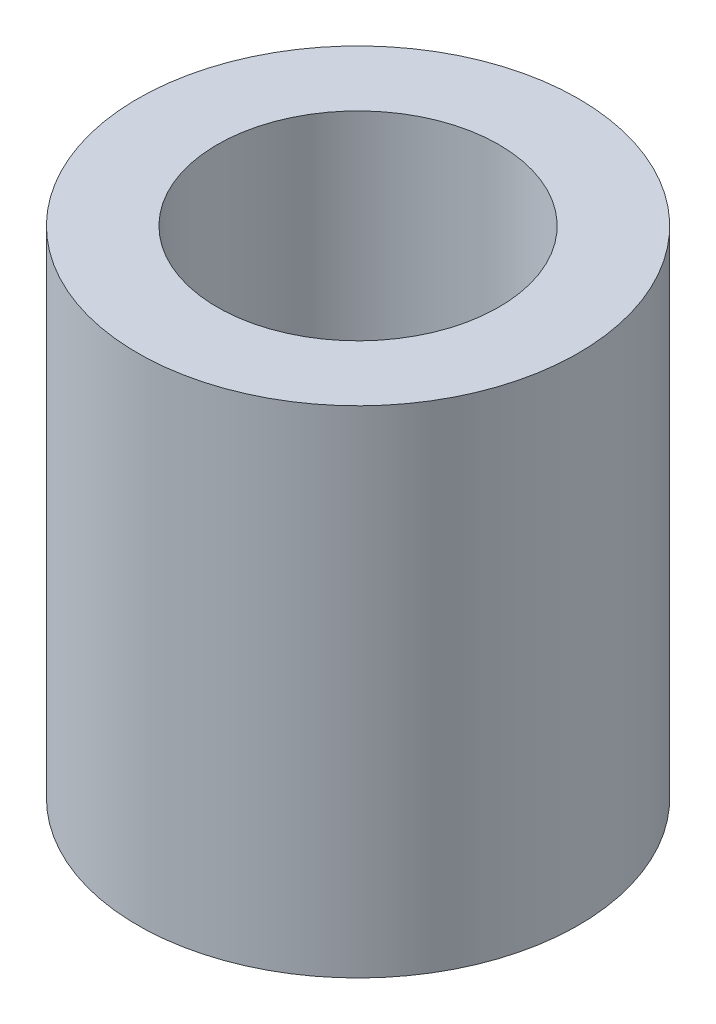
ISO-10303-21;
HEADER;
FILE_DESCRIPTION(('STEP AP214'),'2;1');
FILE_NAME('part.step','',(''),(''),'','','');
FILE_SCHEMA(('AUTOMOTIVE_DESIGN { 1 0 10303 214 1 1 1 1 }'));
ENDSEC;
DATA;
#1=APPLICATION_CONTEXT('core data for automotive mechanical design processes');
#2=APPLICATION_PROTOCOL_DEFINITION('international standard','automotive_design',2000,#1);
#3=PRODUCT_CONTEXT('',#1,'mechanical');
#4=PRODUCT('Part','Part','',(#3));
#5=PRODUCT_RELATED_PRODUCT_CATEGORY('part','',(#4));
#6=PRODUCT_DEFINITION_FORMATION('','',#4);
#7=PRODUCT_DEFINITION_CONTEXT('part definition',#1,'design');
#8=PRODUCT_DEFINITION('design','',#6,#7);
#9=PRODUCT_DEFINITION_SHAPE('','',#8);
#10=(LENGTH_UNIT() NAMED_UNIT(*) SI_UNIT(.MILLI.,.METRE.));
#11=(NAMED_UNIT(*) PLANE_ANGLE_UNIT() SI_UNIT($,.RADIAN.));
#12=(NAMED_UNIT(*) SI_UNIT($,.STERADIAN.) SOLID_ANGLE_UNIT());
#13=UNCERTAINTY_MEASURE_WITH_UNIT(LENGTH_MEASURE(1.E-05),#10,'distance_accuracy_value','');
#14=(GEOMETRIC_REPRESENTATION_CONTEXT(3) GLOBAL_UNCERTAINTY_ASSIGNED_CONTEXT((#13)) GLOBAL_UNIT_ASSIGNED_CONTEXT((#10,
#11,#12)) REPRESENTATION_CONTEXT('',''));
#15=CARTESIAN_POINT('',(0.,0.,0.));
#16=DIRECTION('',(0.,0.,1.));
#17=DIRECTION('',(1.,0.,0.));
#18=AXIS2_PLACEMENT_3D('',#15,#16,#17);
#19=CARTESIAN_POINT('',(0.,39.3483778431595,0.));
#20=DIRECTION('',(0.,-1.,0.));
#21=DIRECTION('',(0.,0.,-1.));
#22=AXIS2_PLACEMENT_3D('',#19,#20,#21);
#23=CYLINDRICAL_SURFACE('',#22,17.5);
#24=CARTESIAN_POINT('',(0.,39.3483778431595,0.));
#25=DIRECTION('',(0.,1.,0.));
#26=DIRECTION('',(0.,0.,1.));
#27=AXIS2_PLACEMENT_3D('',#24,#25,#26);
#28=CIRCLE('',#27,17.5);
#29=CARTESIAN_POINT('',(0.,39.3483778431595,-17.5));
#30=VERTEX_POINT('',#29);
#31=EDGE_CURVE('E10',#30,#30,#28,.T.);
#32=CARTESIAN_POINT('',(0.,0.,0.));
#33=DIRECTION('',(0.,1.,0.));
#34=DIRECTION('',(0.,0.,1.));
#35=AXIS2_PLACEMENT_3D('',#32,#33,#34);
#36=CIRCLE('',#35,17.5);
#37=CARTESIAN_POINT('',(0.,0.,-17.5));
#38=VERTEX_POINT('',#37);
#39=EDGE_CURVE('E37',#38,#38,#36,.T.);
#40=CARTESIAN_POINT('',(0.,39.3483778431595,-17.5));
#41=CARTESIAN_POINT('',(0.,38.9384989072932,-17.5));
#42=CARTESIAN_POINT('',(0.,38.528619971427,-17.5));
#43=CARTESIAN_POINT('',(0.,37.7088620996945,-17.5));
#44=CARTESIAN_POINT('',(0.,37.2989831638283,-17.5));
#45=CARTESIAN_POINT('',(0.,36.4792252920958,-17.5));
#46=CARTESIAN_POINT('',(0.,36.0693463562295,-17.5));
#47=CARTESIAN_POINT('',(0.,35.249588484497,-17.5));
#48=CARTESIAN_POINT('',(0.,34.8397095486308,-17.5));
#49=CARTESIAN_POINT('',(0.,34.0199516768983,-17.5));
#50=CARTESIAN_POINT('',(0.,33.610072741032,-17.5));
#51=CARTESIAN_POINT('',(0.,32.7903148692996,-17.5));
#52=CARTESIAN_POINT('',(0.,32.3804359334333,-17.5));
#53=CARTESIAN_POINT('',(0.,31.5606780617008,-17.5));
#54=CARTESIAN_POINT('',(0.,31.1507991258346,-17.5));
#55=CARTESIAN_POINT('',(0.,30.3310412541021,-17.5));
#56=CARTESIAN_POINT('',(0.,29.9211623182358,-17.5));
#57=CARTESIAN_POINT('',(0.,29.1014044465034,-17.5));
#58=CARTESIAN_POINT('',(0.,28.6915255106371,-17.5));
#59=CARTESIAN_POINT('',(0.,27.8717676389046,-17.5));
#60=CARTESIAN_POINT('',(0.,27.4618887030384,-17.5));
#61=CARTESIAN_POINT('',(0.,26.6421308313059,-17.5));
#62=CARTESIAN_POINT('',(0.,26.2322518954396,-17.5));
#63=CARTESIAN_POINT('',(0.,25.4124940237072,-17.5));
#64=CARTESIAN_POINT('',(0.,25.0026150878409,-17.5));
#65=CARTESIAN_POINT('',(0.,24.1828572161084,-17.5));
#66=CARTESIAN_POINT('',(0.,23.7729782802422,-17.5));
#67=CARTESIAN_POINT('',(0.,22.9532204085097,-17.5));
#68=CARTESIAN_POINT('',(0.,22.5433414726434,-17.5));
#69=CARTESIAN_POINT('',(0.,21.723583600911,-17.5));
#70=CARTESIAN_POINT('',(0.,21.3137046650447,-17.5));
#71=CARTESIAN_POINT('',(0.,20.4939467933122,-17.5));
#72=CARTESIAN_POINT('',(0.,20.084067857446,-17.5));
#73=CARTESIAN_POINT('',(0.,19.2643099857135,-17.5));
#74=CARTESIAN_POINT('',(0.,18.8544310498472,-17.5));
#75=CARTESIAN_POINT('',(0.,18.0346731781148,-17.5));
#76=CARTESIAN_POINT('',(0.,17.6247942422485,-17.5));
#77=CARTESIAN_POINT('',(0.,16.805036370516,-17.5));
#78=CARTESIAN_POINT('',(0.,16.3951574346498,-17.5));
#79=CARTESIAN_POINT('',(0.,15.5753995629173,-17.5));
#80=CARTESIAN_POINT('',(0.,15.165520627051,-17.5));
#81=CARTESIAN_POINT('',(0.,14.3457627553186,-17.5));
#82=CARTESIAN_POINT('',(0.,13.9358838194523,-17.5));
#83=CARTESIAN_POINT('',(0.,13.1161259477198,-17.5));
#84=CARTESIAN_POINT('',(0.,12.7062470118536,-17.5));
#85=CARTESIAN_POINT('',(0.,11.8864891401211,-17.5));
#86=CARTESIAN_POINT('',(0.,11.4766102042548,-17.5));
#87=CARTESIAN_POINT('',(0.,10.6568523325223,-17.5));
#88=CARTESIAN_POINT('',(0.,10.2469733966561,-17.5));
#89=CARTESIAN_POINT('',(0.,9.42721552492361,-17.5));
#90=CARTESIAN_POINT('',(0.,9.01733658905737,-17.5));
#91=CARTESIAN_POINT('',(0.,8.19757871732488,-17.5));
#92=CARTESIAN_POINT('',(0.,7.78769978145864,-17.5));
#93=CARTESIAN_POINT('',(0.,6.96794190972615,-17.5));
#94=CARTESIAN_POINT('',(0.,6.55806297385991,-17.5));
#95=CARTESIAN_POINT('',(0.,5.73830510212742,-17.5));
#96=CARTESIAN_POINT('',(0.,5.32842616626117,-17.5));
#97=CARTESIAN_POINT('',(0.,4.50866829452868,-17.5));
#98=CARTESIAN_POINT('',(0.,4.09878935866244,-17.5));
#99=CARTESIAN_POINT('',(0.,3.27903148692995,-17.5));
#100=CARTESIAN_POINT('',(0.,2.86915255106371,-17.5));
#101=CARTESIAN_POINT('',(0.,2.04939467933122,-17.5));
#102=CARTESIAN_POINT('',(0.,1.63951574346497,-17.5));
#103=CARTESIAN_POINT('',(0.,0.819757871732484,-17.5));
#104=CARTESIAN_POINT('',(0.,0.409878935866239,-17.5));
#105=CARTESIAN_POINT('',(0.,0.,-17.5));
#106=B_SPLINE_CURVE_WITH_KNOTS('',3,(#40,#41,#42,#43,#44,#45,#46,#47,#48,#49,#50,#51,#52,#53,
#54,#55,#56,#57,#58,#59,#60,#61,#62,#63,#64,#65,#66,#67,#68,#69,#70,#71,#72,#73,#74,#75,#76,#77,
#78,#79,#80,#81,#82,#83,#84,#85,#86,#87,#88,#89,#90,#91,#92,#93,#94,#95,#96,#97,#98,#99,#100,
#101,#102,#103,#104,#105),.UNSPECIFIED.,.F.,.F.,(4,2,2,2,2,2,2,2,2,2,2,2,2,2,2,2,2,2,2,2,2,2,2,
2,2,2,2,2,2,2,2,2,4),(0.,1.22963680759874,2.45927361519747,3.6889104227962,4.91854723039494,
6.14818403799367,7.37782084559241,8.60745765319114,9.83709446078988,11.0667312683886,
12.2963680759873,13.5260048835861,14.7556416911848,15.9852784987835,17.2149153063823,
18.444552113981,19.6741889215797,20.9038257291785,22.1334625367772,23.3630993443759,
24.5927361519747,25.8223729595734,27.0520097671722,28.2816465747709,29.5112833823696,
30.7409201899684,31.9705569975671,33.2001938051658,34.4298306127645,35.6594674203633,
36.889104227962,38.1187410355607,39.3483778431595),.UNSPECIFIED.);
#107=EDGE_CURVE('BSEAM40',#30,#38,#106,.T.);
#108=ORIENTED_EDGE('',*,*,#31,.F.);
#109=ORIENTED_EDGE('',*,*,#39,.T.);
#110=ORIENTED_EDGE('',*,*,#107,.T.);
#111=ORIENTED_EDGE('',*,*,#107,.F.);
#112=EDGE_LOOP('',(#108,#110,#109,#111));
#113=FACE_BOUND('',#112,.T.);
#114=ADVANCED_FACE('F40',(#113),#23,.T.);
#115=CARTESIAN_POINT('',(0.,39.3483778431595,0.));
#116=DIRECTION('',(0.,1.,0.));
#117=DIRECTION('',(0.,0.,1.));
#118=AXIS2_PLACEMENT_3D('',#115,#116,#117);
#119=PLANE('',#118);
#120=CARTESIAN_POINT('',(0.,39.3483778431595,0.));
#121=DIRECTION('',(0.,1.,0.));
#122=DIRECTION('',(0.,0.,1.));
#123=AXIS2_PLACEMENT_3D('',#120,#121,#122);
#124=CIRCLE('',#123,11.1824868431297);
#125=CARTESIAN_POINT('',(0.,39.3483778431595,-11.1824868431297));
#126=VERTEX_POINT('',#125);
#127=EDGE_CURVE('E50',#126,#126,#124,.T.);
#128=ORIENTED_EDGE('',*,*,#127,.F.);
#129=EDGE_LOOP('',(#128));
#130=FACE_BOUND('',#129,.T.);
#131=ORIENTED_EDGE('',*,*,#31,.T.);
#132=EDGE_LOOP('',(#131));
#133=FACE_BOUND('',#132,.T.);
#134=ADVANCED_FACE('F59',(#130,#133),#119,.T.);
#135=CARTESIAN_POINT('',(0.,0.,0.));
#136=DIRECTION('',(0.,1.,0.));
#137=DIRECTION('',(0.,0.,1.));
#138=AXIS2_PLACEMENT_3D('',#135,#136,#137);
#139=PLANE('',#138);
#140=CARTESIAN_POINT('',(0.,0.,0.));
#141=DIRECTION('',(0.,1.,0.));
#142=DIRECTION('',(0.,0.,1.));
#143=AXIS2_PLACEMENT_3D('',#140,#141,#142);
#144=CIRCLE('',#143,11.1824868431297);
#145=CARTESIAN_POINT('',(0.,0.,-11.1824868431297));
#146=VERTEX_POINT('',#145);
#147=EDGE_CURVE('E47',#146,#146,#144,.T.);
#148=ORIENTED_EDGE('',*,*,#147,.T.);
#149=EDGE_LOOP('',(#148));
#150=FACE_BOUND('',#149,.T.);
#151=ORIENTED_EDGE('',*,*,#39,.F.);
#152=EDGE_LOOP('',(#151));
#153=FACE_BOUND('',#152,.T.);
#154=ADVANCED_FACE('F58',(#150,#153),#139,.F.);
#155=CARTESIAN_POINT('',(0.,39.3483778431595,0.));
#156=DIRECTION('',(0.,-1.,0.));
#157=DIRECTION('',(0.,0.,-1.));
#158=AXIS2_PLACEMENT_3D('',#155,#156,#157);
#159=CYLINDRICAL_SURFACE('',#158,11.1824868431297);
#160=CARTESIAN_POINT('',(0.,39.3483778431595,-11.1824868431297));
#161=CARTESIAN_POINT('',(0.,38.9384989072932,-11.1824868431297));
#162=CARTESIAN_POINT('',(0.,38.528619971427,-11.1824868431297));
#163=CARTESIAN_POINT('',(0.,37.7088620996945,-11.1824868431297));
#164=CARTESIAN_POINT('',(0.,37.2989831638283,-11.1824868431297));
#165=CARTESIAN_POINT('',(0.,36.4792252920958,-11.1824868431297));
#166=CARTESIAN_POINT('',(0.,36.0693463562295,-11.1824868431297));
#167=CARTESIAN_POINT('',(0.,35.249588484497,-11.1824868431297));
#168=CARTESIAN_POINT('',(0.,34.8397095486308,-11.1824868431297));
#169=CARTESIAN_POINT('',(0.,34.0199516768983,-11.1824868431297));
#170=CARTESIAN_POINT('',(0.,33.6100727410321,-11.1824868431297));
#171=CARTESIAN_POINT('',(0.,32.7903148692996,-11.1824868431297));
#172=CARTESIAN_POINT('',(0.,32.3804359334333,-11.1824868431297));
#173=CARTESIAN_POINT('',(0.,31.5606780617008,-11.1824868431297));
#174=CARTESIAN_POINT('',(0.,31.1507991258346,-11.1824868431297));
#175=CARTESIAN_POINT('',(0.,30.3310412541021,-11.1824868431297));
#176=CARTESIAN_POINT('',(0.,29.9211623182358,-11.1824868431297));
#177=CARTESIAN_POINT('',(0.,29.1014044465034,-11.1824868431297));
#178=CARTESIAN_POINT('',(0.,28.6915255106371,-11.1824868431297));
#179=CARTESIAN_POINT('',(0.,27.8717676389046,-11.1824868431297));
#180=CARTESIAN_POINT('',(0.,27.4618887030384,-11.1824868431297));
#181=CARTESIAN_POINT('',(0.,26.6421308313059,-11.1824868431297));
#182=CARTESIAN_POINT('',(0.,26.2322518954396,-11.1824868431297));
#183=CARTESIAN_POINT('',(0.,25.4124940237072,-11.1824868431297));
#184=CARTESIAN_POINT('',(0.,25.0026150878409,-11.1824868431297));
#185=CARTESIAN_POINT('',(0.,24.1828572161084,-11.1824868431297));
#186=CARTESIAN_POINT('',(0.,23.7729782802422,-11.1824868431297));
#187=CARTESIAN_POINT('',(0.,22.9532204085097,-11.1824868431297));
#188=CARTESIAN_POINT('',(0.,22.5433414726434,-11.1824868431297));
#189=CARTESIAN_POINT('',(0.,21.723583600911,-11.1824868431297));
#190=CARTESIAN_POINT('',(0.,21.3137046650447,-11.1824868431297));
#191=CARTESIAN_POINT('',(0.,20.4939467933122,-11.1824868431297));
#192=CARTESIAN_POINT('',(0.,20.084067857446,-11.1824868431297));
#193=CARTESIAN_POINT('',(0.,19.2643099857135,-11.1824868431297));
#194=CARTESIAN_POINT('',(0.,18.8544310498472,-11.1824868431297));
#195=CARTESIAN_POINT('',(0.,18.0346731781148,-11.1824868431297));
#196=CARTESIAN_POINT('',(0.,17.6247942422485,-11.1824868431297));
#197=CARTESIAN_POINT('',(0.,16.805036370516,-11.1824868431297));
#198=CARTESIAN_POINT('',(0.,16.3951574346498,-11.1824868431297));
#199=CARTESIAN_POINT('',(0.,15.5753995629173,-11.1824868431297));
#200=CARTESIAN_POINT('',(0.,15.165520627051,-11.1824868431297));
#201=CARTESIAN_POINT('',(0.,14.3457627553186,-11.1824868431297));
#202=CARTESIAN_POINT('',(0.,13.9358838194523,-11.1824868431297));
#203=CARTESIAN_POINT('',(0.,13.1161259477198,-11.1824868431297));
#204=CARTESIAN_POINT('',(0.,12.7062470118536,-11.1824868431297));
#205=CARTESIAN_POINT('',(0.,11.8864891401211,-11.1824868431297));
#206=CARTESIAN_POINT('',(0.,11.4766102042548,-11.1824868431297));
#207=CARTESIAN_POINT('',(0.,10.6568523325224,-11.1824868431297));
#208=CARTESIAN_POINT('',(0.,10.2469733966561,-11.1824868431297));
#209=CARTESIAN_POINT('',(0.,9.42721552492362,-11.1824868431297));
#210=CARTESIAN_POINT('',(0.,9.01733658905737,-11.1824868431297));
#211=CARTESIAN_POINT('',(0.,8.19757871732488,-11.1824868431297));
#212=CARTESIAN_POINT('',(0.,7.78769978145864,-11.1824868431297));
#213=CARTESIAN_POINT('',(0.,6.96794190972615,-11.1824868431297));
#214=CARTESIAN_POINT('',(0.,6.55806297385991,-11.1824868431297));
#215=CARTESIAN_POINT('',(0.,5.73830510212742,-11.1824868431297));
#216=CARTESIAN_POINT('',(0.,5.32842616626117,-11.1824868431297));
#217=CARTESIAN_POINT('',(0.,4.50866829452868,-11.1824868431297));
#218=CARTESIAN_POINT('',(0.,4.09878935866244,-11.1824868431297));
#219=CARTESIAN_POINT('',(0.,3.27903148692995,-11.1824868431297));
#220=CARTESIAN_POINT('',(0.,2.86915255106371,-11.1824868431297));
#221=CARTESIAN_POINT('',(0.,2.04939467933122,-11.1824868431297));
#222=CARTESIAN_POINT('',(0.,1.63951574346497,-11.1824868431297));
#223=CARTESIAN_POINT('',(0.,0.819757871732484,-11.1824868431297));
#224=CARTESIAN_POINT('',(0.,0.409878935866239,-11.1824868431297));
#225=CARTESIAN_POINT('',(0.,0.,-11.1824868431297));
#226=B_SPLINE_CURVE_WITH_KNOTS('',3,(#160,#161,#162,#163,#164,#165,#166,#167,#168,#169,#170,
#171,#172,#173,#174,#175,#176,#177,#178,#179,#180,#181,#182,#183,#184,#185,#186,#187,#188,#189,
#190,#191,#192,#193,#194,#195,#196,#197,#198,#199,#200,#201,#202,#203,#204,#205,#206,#207,#208,
#209,#210,#211,#212,#213,#214,#215,#216,#217,#218,#219,#220,#221,#222,#223,#224,#225),
.UNSPECIFIED.,.F.,.F.,(4,2,2,2,2,2,2,2,2,2,2,2,2,2,2,2,2,2,2,2,2,2,2,2,2,2,2,2,2,2,2,2,4),(0.,
1.22963680759873,2.45927361519747,3.6889104227962,4.91854723039493,6.14818403799366,
7.3778208455924,8.60745765319113,9.83709446078987,11.0667312683886,12.2963680759873,
13.5260048835861,14.7556416911848,15.9852784987835,17.2149153063823,18.444552113981,
19.6741889215797,20.9038257291785,22.1334625367772,23.3630993443759,24.5927361519747,
25.8223729595734,27.0520097671721,28.2816465747709,29.5112833823696,30.7409201899683,
31.9705569975671,33.2001938051658,34.4298306127645,35.6594674203633,36.889104227962,
38.1187410355607,39.3483778431595),.UNSPECIFIED.);
#227=EDGE_CURVE('BSEAM54',#126,#146,#226,.T.);
#228=ORIENTED_EDGE('',*,*,#127,.T.);
#229=ORIENTED_EDGE('',*,*,#147,.F.);
#230=ORIENTED_EDGE('',*,*,#227,.T.);
#231=ORIENTED_EDGE('',*,*,#227,.F.);
#232=EDGE_LOOP('',(#228,#230,#229,#231));
#233=FACE_BOUND('',#232,.T.);
#234=ADVANCED_FACE('F54',(#233),#159,.F.);
#235=CLOSED_SHELL('',(#114,#134,#154,#234));
#236=MANIFOLD_SOLID_BREP('B2',#235);
#237=ADVANCED_BREP_SHAPE_REPRESENTATION('',(#18,#236),#14);
#238=SHAPE_DEFINITION_REPRESENTATION(#9,#237);
ENDSEC;
END-ISO-10303-21;
